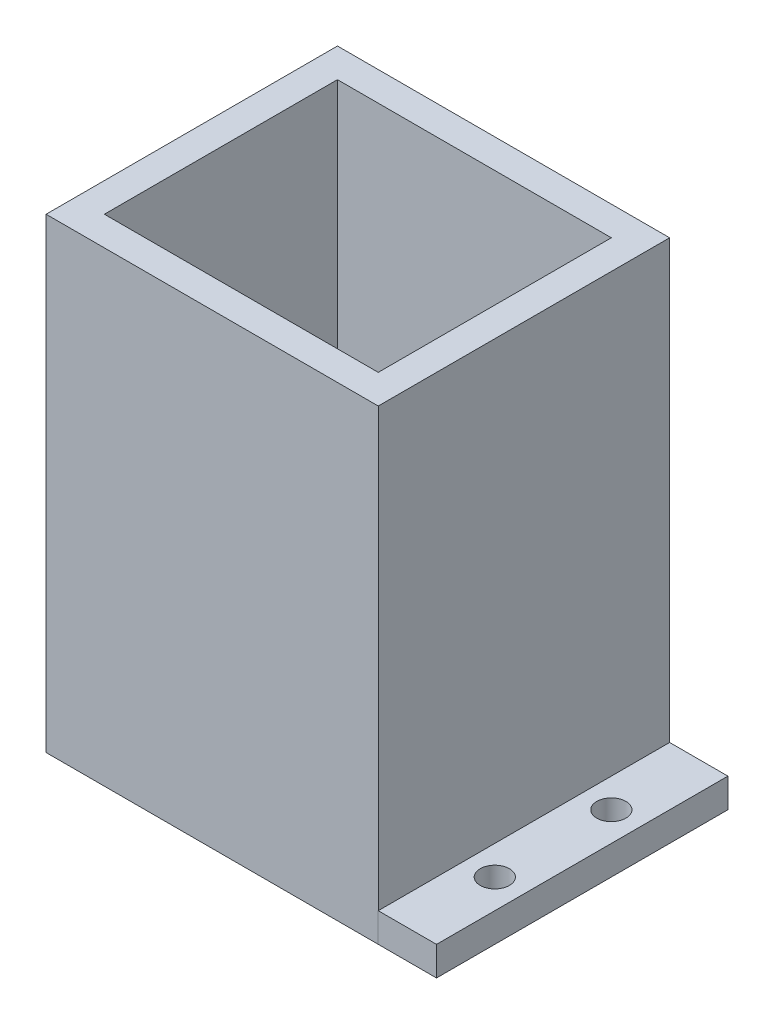
ISO-10303-21;
HEADER;
FILE_DESCRIPTION(('STEP AP214'),'2;1');
FILE_NAME('part.step','',(''),(''),'','','');
FILE_SCHEMA(('AUTOMOTIVE_DESIGN { 1 0 10303 214 1 1 1 1 }'));
ENDSEC;
DATA;
#1=APPLICATION_CONTEXT('core data for automotive mechanical design processes');
#2=APPLICATION_PROTOCOL_DEFINITION('international standard','automotive_design',2000,#1);
#3=PRODUCT_CONTEXT('',#1,'mechanical');
#4=PRODUCT('Part','Part','',(#3));
#5=PRODUCT_RELATED_PRODUCT_CATEGORY('part','',(#4));
#6=PRODUCT_DEFINITION_FORMATION('','',#4);
#7=PRODUCT_DEFINITION_CONTEXT('part definition',#1,'design');
#8=PRODUCT_DEFINITION('design','',#6,#7);
#9=PRODUCT_DEFINITION_SHAPE('','',#8);
#10=(LENGTH_UNIT() NAMED_UNIT(*) SI_UNIT(.MILLI.,.METRE.));
#11=(NAMED_UNIT(*) PLANE_ANGLE_UNIT() SI_UNIT($,.RADIAN.));
#12=(NAMED_UNIT(*) SI_UNIT($,.STERADIAN.) SOLID_ANGLE_UNIT());
#13=UNCERTAINTY_MEASURE_WITH_UNIT(LENGTH_MEASURE(1.E-05),#10,'distance_accuracy_value','');
#14=(GEOMETRIC_REPRESENTATION_CONTEXT(3) GLOBAL_UNCERTAINTY_ASSIGNED_CONTEXT((#13)) GLOBAL_UNIT_ASSIGNED_CONTEXT((#10,
#11,#12)) REPRESENTATION_CONTEXT('',''));
#15=CARTESIAN_POINT('',(0.,0.,0.));
#16=DIRECTION('',(0.,0.,1.));
#17=DIRECTION('',(1.,0.,0.));
#18=AXIS2_PLACEMENT_3D('',#15,#16,#17);
#19=CARTESIAN_POINT('',(53.7182320441989,80.,-2.45303867403315));
#20=DIRECTION('',(-1.,0.,0.));
#21=DIRECTION('',(0.,0.,1.));
#22=AXIS2_PLACEMENT_3D('',#19,#20,#21);
#23=PLANE('',#22);
#24=DIRECTION('',(0.,0.,1.));
#25=VECTOR('',#24,1.);
#26=CARTESIAN_POINT('',(53.7182320441989,5.,-2.45303867403315));
#27=LINE('',#26,#25);
#28=CARTESIAN_POINT('',(53.7182320441989,5.,-2.45303867403315));
#29=VERTEX_POINT('',#28);
#30=CARTESIAN_POINT('',(53.7182320441989,5.,47.5469613259669));
#31=VERTEX_POINT('',#30);
#32=EDGE_CURVE('E56',#29,#31,#27,.T.);
#33=ORIENTED_EDGE('',*,*,#32,.F.);
#34=DIRECTION('',(0.,-1.,0.));
#35=VECTOR('',#34,1.);
#36=CARTESIAN_POINT('',(53.7182320441989,80.,-2.45303867403315));
#37=LINE('',#36,#35);
#38=CARTESIAN_POINT('',(53.7182320441989,80.,-2.45303867403315));
#39=VERTEX_POINT('',#38);
#40=EDGE_CURVE('E206',#39,#29,#37,.T.);
#41=ORIENTED_EDGE('',*,*,#40,.F.);
#42=DIRECTION('',(0.,0.,-1.));
#43=VECTOR('',#42,1.);
#44=CARTESIAN_POINT('',(53.7182320441989,80.,-2.45303867403315));
#45=LINE('',#44,#43);
#46=CARTESIAN_POINT('',(53.7182320441989,80.,47.5469613259669));
#47=VERTEX_POINT('',#46);
#48=EDGE_CURVE('E194',#47,#39,#45,.T.);
#49=ORIENTED_EDGE('',*,*,#48,.F.);
#50=DIRECTION('',(0.,-1.,0.));
#51=VECTOR('',#50,1.);
#52=CARTESIAN_POINT('',(53.7182320441989,80.,47.5469613259669));
#53=LINE('',#52,#51);
#54=EDGE_CURVE('E49',#47,#31,#53,.T.);
#55=ORIENTED_EDGE('',*,*,#54,.T.);
#56=EDGE_LOOP('',(#33,#41,#49,#55));
#57=FACE_BOUND('',#56,.T.);
#58=ADVANCED_FACE('F41',(#57),#23,.F.);
#59=CARTESIAN_POINT('',(-3.28176795580111,80.,-2.45303867403315));
#60=DIRECTION('',(1.,0.,0.));
#61=DIRECTION('',(0.,0.,-1.));
#62=AXIS2_PLACEMENT_3D('',#59,#60,#61);
#63=PLANE('',#62);
#64=DIRECTION('',(0.,0.,1.));
#65=VECTOR('',#64,1.);
#66=CARTESIAN_POINT('',(-3.28176795580111,0.,-2.45303867403315));
#67=LINE('',#66,#65);
#68=CARTESIAN_POINT('',(-3.28176795580111,0.,-2.45303867403315));
#69=VERTEX_POINT('',#68);
#70=CARTESIAN_POINT('',(-3.2817679558011,0.,47.5469613259669));
#71=VERTEX_POINT('',#70);
#72=EDGE_CURVE('E182',#69,#71,#67,.T.);
#73=ORIENTED_EDGE('',*,*,#72,.T.);
#74=DIRECTION('',(0.,-1.,0.));
#75=VECTOR('',#74,1.);
#76=CARTESIAN_POINT('',(-3.2817679558011,80.,47.5469613259669));
#77=LINE('',#76,#75);
#78=CARTESIAN_POINT('',(-3.2817679558011,80.,47.5469613259669));
#79=VERTEX_POINT('',#78);
#80=EDGE_CURVE('E11',#79,#71,#77,.T.);
#81=ORIENTED_EDGE('',*,*,#80,.F.);
#82=DIRECTION('',(0.,0.,1.));
#83=VECTOR('',#82,1.);
#84=CARTESIAN_POINT('',(-3.28176795580111,80.,-2.45303867403315));
#85=LINE('',#84,#83);
#86=CARTESIAN_POINT('',(-3.28176795580111,80.,-2.45303867403315));
#87=VERTEX_POINT('',#86);
#88=EDGE_CURVE('E188',#87,#79,#85,.T.);
#89=ORIENTED_EDGE('',*,*,#88,.F.);
#90=DIRECTION('',(0.,-1.,0.));
#91=VECTOR('',#90,1.);
#92=CARTESIAN_POINT('',(-3.28176795580111,80.,-2.45303867403315));
#93=LINE('',#92,#91);
#94=EDGE_CURVE('E198',#87,#69,#93,.T.);
#95=ORIENTED_EDGE('',*,*,#94,.T.);
#96=EDGE_LOOP('',(#73,#81,#89,#95));
#97=FACE_BOUND('',#96,.T.);
#98=ADVANCED_FACE('F43',(#97),#63,.F.);
#99=CARTESIAN_POINT('',(-3.2817679558011,80.,47.5469613259669));
#100=DIRECTION('',(0.,0.,-1.));
#101=DIRECTION('',(-1.,0.,0.));
#102=AXIS2_PLACEMENT_3D('',#99,#100,#101);
#103=PLANE('',#102);
#104=DIRECTION('',(1.,0.,0.));
#105=VECTOR('',#104,1.);
#106=CARTESIAN_POINT('',(-3.2817679558011,0.,47.5469613259669));
#107=LINE('',#106,#105);
#108=CARTESIAN_POINT('',(53.7182320441989,0.,47.5469613259669));
#109=VERTEX_POINT('',#108);
#110=EDGE_CURVE('E201',#71,#109,#107,.T.);
#111=ORIENTED_EDGE('',*,*,#110,.T.);
#112=EDGE_CURVE('E207',#31,#109,#53,.T.);
#113=ORIENTED_EDGE('',*,*,#112,.F.);
#114=ORIENTED_EDGE('',*,*,#54,.F.);
#115=DIRECTION('',(1.,0.,0.));
#116=VECTOR('',#115,1.);
#117=CARTESIAN_POINT('',(-3.2817679558011,80.,47.5469613259669));
#118=LINE('',#117,#116);
#119=EDGE_CURVE('E191',#79,#47,#118,.T.);
#120=ORIENTED_EDGE('',*,*,#119,.F.);
#121=ORIENTED_EDGE('',*,*,#80,.T.);
#122=EDGE_LOOP('',(#111,#113,#114,#120,#121));
#123=FACE_BOUND('',#122,.T.);
#124=ADVANCED_FACE('F264',(#123),#103,.F.);
#125=CARTESIAN_POINT('',(-3.28176795580111,80.,-2.45303867403315));
#126=DIRECTION('',(0.,0.,1.));
#127=DIRECTION('',(1.,0.,0.));
#128=AXIS2_PLACEMENT_3D('',#125,#126,#127);
#129=PLANE('',#128);
#130=DIRECTION('',(-1.,0.,0.));
#131=VECTOR('',#130,1.);
#132=CARTESIAN_POINT('',(-3.28176795580111,0.,-2.45303867403315));
#133=LINE('',#132,#131);
#134=CARTESIAN_POINT('',(63.7182320441989,0.,-2.45303867403315));
#135=VERTEX_POINT('',#134);
#136=EDGE_CURVE('E192',#135,#69,#133,.T.);
#137=ORIENTED_EDGE('',*,*,#136,.T.);
#138=ORIENTED_EDGE('',*,*,#94,.F.);
#139=DIRECTION('',(-1.,0.,0.));
#140=VECTOR('',#139,1.);
#141=CARTESIAN_POINT('',(-3.28176795580111,80.,-2.45303867403315));
#142=LINE('',#141,#140);
#143=EDGE_CURVE('E196',#39,#87,#142,.T.);
#144=ORIENTED_EDGE('',*,*,#143,.F.);
#145=ORIENTED_EDGE('',*,*,#40,.T.);
#146=DIRECTION('',(-1.,0.,0.));
#147=VECTOR('',#146,1.);
#148=CARTESIAN_POINT('',(53.7182320441989,5.,-2.45303867403315));
#149=LINE('',#148,#147);
#150=CARTESIAN_POINT('',(63.7182320441989,5.,-2.45303867403315));
#151=VERTEX_POINT('',#150);
#152=EDGE_CURVE('E225',#151,#29,#149,.T.);
#153=ORIENTED_EDGE('',*,*,#152,.F.);
#154=DIRECTION('',(0.,-1.,0.));
#155=VECTOR('',#154,1.);
#156=CARTESIAN_POINT('',(63.7182320441989,5.,-2.45303867403315));
#157=LINE('',#156,#155);
#158=EDGE_CURVE('E155',#151,#135,#157,.T.);
#159=ORIENTED_EDGE('',*,*,#158,.T.);
#160=EDGE_LOOP('',(#137,#138,#144,#145,#153,#159));
#161=FACE_BOUND('',#160,.T.);
#162=ADVANCED_FACE('F267',(#161),#129,.F.);
#163=CARTESIAN_POINT('',(0.,80.,0.));
#164=DIRECTION('',(0.,1.,0.));
#165=DIRECTION('',(0.,0.,1.));
#166=AXIS2_PLACEMENT_3D('',#163,#164,#165);
#167=PLANE('',#166);
#168=DIRECTION('',(0.,0.,1.));
#169=VECTOR('',#168,1.);
#170=CARTESIAN_POINT('',(1.71823204419891,80.,2.54696132596685));
#171=LINE('',#170,#169);
#172=CARTESIAN_POINT('',(1.71823204419891,80.,2.54696132596685));
#173=VERTEX_POINT('',#172);
#174=CARTESIAN_POINT('',(1.71823204419891,80.,42.5469613259669));
#175=VERTEX_POINT('',#174);
#176=EDGE_CURVE('E64',#173,#175,#171,.T.);
#177=ORIENTED_EDGE('',*,*,#176,.F.);
#178=DIRECTION('',(-1.,0.,0.));
#179=VECTOR('',#178,1.);
#180=CARTESIAN_POINT('',(1.71823204419891,80.,2.54696132596685));
#181=LINE('',#180,#179);
#182=CARTESIAN_POINT('',(48.7182320441989,80.,2.54696132596685));
#183=VERTEX_POINT('',#182);
#184=EDGE_CURVE('E163',#183,#173,#181,.T.);
#185=ORIENTED_EDGE('',*,*,#184,.F.);
#186=DIRECTION('',(0.,0.,-1.));
#187=VECTOR('',#186,1.);
#188=CARTESIAN_POINT('',(48.7182320441989,80.,2.54696132596685));
#189=LINE('',#188,#187);
#190=CARTESIAN_POINT('',(48.7182320441989,80.,42.5469613259669));
#191=VERTEX_POINT('',#190);
#192=EDGE_CURVE('E175',#191,#183,#189,.T.);
#193=ORIENTED_EDGE('',*,*,#192,.F.);
#194=DIRECTION('',(1.,0.,0.));
#195=VECTOR('',#194,1.);
#196=CARTESIAN_POINT('',(1.71823204419891,80.,42.5469613259669));
#197=LINE('',#196,#195);
#198=EDGE_CURVE('E153',#175,#191,#197,.T.);
#199=ORIENTED_EDGE('',*,*,#198,.F.);
#200=EDGE_LOOP('',(#177,#185,#193,#199));
#201=FACE_BOUND('',#200,.T.);
#202=ORIENTED_EDGE('',*,*,#88,.T.);
#203=ORIENTED_EDGE('',*,*,#119,.T.);
#204=ORIENTED_EDGE('',*,*,#48,.T.);
#205=ORIENTED_EDGE('',*,*,#143,.T.);
#206=EDGE_LOOP('',(#202,#203,#204,#205));
#207=FACE_BOUND('',#206,.T.);
#208=ADVANCED_FACE('F273',(#201,#207),#167,.T.);
#209=CARTESIAN_POINT('',(0.,0.,0.));
#210=DIRECTION('',(0.,1.,0.));
#211=DIRECTION('',(0.,0.,1.));
#212=AXIS2_PLACEMENT_3D('',#209,#210,#211);
#213=PLANE('',#212);
#214=ORIENTED_EDGE('',*,*,#72,.F.);
#215=ORIENTED_EDGE('',*,*,#136,.F.);
#216=DIRECTION('',(0.,0.,-1.));
#217=VECTOR('',#216,1.);
#218=CARTESIAN_POINT('',(63.7182320441989,0.,-2.45303867403315));
#219=LINE('',#218,#217);
#220=CARTESIAN_POINT('',(63.7182320441989,0.,47.5510673048378));
#221=VERTEX_POINT('',#220);
#222=EDGE_CURVE('E137',#221,#135,#219,.T.);
#223=ORIENTED_EDGE('',*,*,#222,.F.);
#224=DIRECTION('',(1.,0.,0.));
#225=VECTOR('',#224,1.);
#226=CARTESIAN_POINT('',(53.7182320441989,0.,47.5510673048378));
#227=LINE('',#226,#225);
#228=CARTESIAN_POINT('',(53.7182320441989,0.,47.5510673048378));
#229=VERTEX_POINT('',#228);
#230=EDGE_CURVE('E217',#229,#221,#227,.T.);
#231=ORIENTED_EDGE('',*,*,#230,.F.);
#232=DIRECTION('',(0.,0.,1.));
#233=VECTOR('',#232,1.);
#234=CARTESIAN_POINT('',(53.7182320441989,0.,-2.45303867403315));
#235=LINE('',#234,#233);
#236=EDGE_CURVE('E150',#109,#229,#235,.T.);
#237=ORIENTED_EDGE('',*,*,#236,.F.);
#238=ORIENTED_EDGE('',*,*,#110,.F.);
#239=EDGE_LOOP('',(#214,#215,#223,#231,#237,#238));
#240=FACE_BOUND('',#239,.T.);
#241=CARTESIAN_POINT('',(58.7182320441989,0.,12.5510673048378));
#242=DIRECTION('',(0.,1.,0.));
#243=DIRECTION('',(0.,0.,1.));
#244=AXIS2_PLACEMENT_3D('',#241,#242,#243);
#245=CIRCLE('',#244,2.5);
#246=CARTESIAN_POINT('',(58.7182320441989,0.,15.0510673048378));
#247=VERTEX_POINT('',#246);
#248=EDGE_CURVE('E222',#247,#247,#245,.T.);
#249=ORIENTED_EDGE('',*,*,#248,.T.);
#250=EDGE_LOOP('',(#249));
#251=FACE_BOUND('',#250,.T.);
#252=CARTESIAN_POINT('',(58.7182320441989,0.,32.5510673048378));
#253=DIRECTION('',(0.,1.,0.));
#254=DIRECTION('',(0.,0.,1.));
#255=AXIS2_PLACEMENT_3D('',#252,#253,#254);
#256=CIRCLE('',#255,2.5);
#257=CARTESIAN_POINT('',(58.7182320441989,0.,35.0510673048378));
#258=VERTEX_POINT('',#257);
#259=EDGE_CURVE('E237',#258,#258,#256,.T.);
#260=ORIENTED_EDGE('',*,*,#259,.T.);
#261=EDGE_LOOP('',(#260));
#262=FACE_BOUND('',#261,.T.);
#263=ADVANCED_FACE('F214',(#240,#251,#262),#213,.F.);
#264=CARTESIAN_POINT('',(1.71823204419891,5.,2.54696132596685));
#265=DIRECTION('',(-1.,0.,0.));
#266=DIRECTION('',(0.,0.,1.));
#267=AXIS2_PLACEMENT_3D('',#264,#265,#266);
#268=PLANE('',#267);
#269=ORIENTED_EDGE('',*,*,#176,.T.);
#270=DIRECTION('',(0.,1.,0.));
#271=VECTOR('',#270,1.);
#272=CARTESIAN_POINT('',(1.71823204419891,5.,42.5469613259669));
#273=LINE('',#272,#271);
#274=CARTESIAN_POINT('',(1.71823204419891,5.,42.5469613259669));
#275=VERTEX_POINT('',#274);
#276=EDGE_CURVE('E171',#275,#175,#273,.T.);
#277=ORIENTED_EDGE('',*,*,#276,.F.);
#278=DIRECTION('',(0.,0.,1.));
#279=VECTOR('',#278,1.);
#280=CARTESIAN_POINT('',(1.71823204419891,5.,2.54696132596685));
#281=LINE('',#280,#279);
#282=CARTESIAN_POINT('',(1.71823204419891,5.,2.54696132596685));
#283=VERTEX_POINT('',#282);
#284=EDGE_CURVE('E159',#283,#275,#281,.T.);
#285=ORIENTED_EDGE('',*,*,#284,.F.);
#286=DIRECTION('',(0.,1.,0.));
#287=VECTOR('',#286,1.);
#288=CARTESIAN_POINT('',(1.71823204419891,5.,2.54696132596685));
#289=LINE('',#288,#287);
#290=EDGE_CURVE('E180',#283,#173,#289,.T.);
#291=ORIENTED_EDGE('',*,*,#290,.T.);
#292=EDGE_LOOP('',(#269,#277,#285,#291));
#293=FACE_BOUND('',#292,.T.);
#294=ADVANCED_FACE('F286',(#293),#268,.F.);
#295=CARTESIAN_POINT('',(1.71823204419891,5.,2.54696132596685));
#296=DIRECTION('',(0.,0.,-1.));
#297=DIRECTION('',(-1.,0.,0.));
#298=AXIS2_PLACEMENT_3D('',#295,#296,#297);
#299=PLANE('',#298);
#300=ORIENTED_EDGE('',*,*,#184,.T.);
#301=ORIENTED_EDGE('',*,*,#290,.F.);
#302=DIRECTION('',(-1.,0.,0.));
#303=VECTOR('',#302,1.);
#304=CARTESIAN_POINT('',(1.71823204419891,5.,2.54696132596685));
#305=LINE('',#304,#303);
#306=CARTESIAN_POINT('',(48.7182320441989,5.,2.54696132596685));
#307=VERTEX_POINT('',#306);
#308=EDGE_CURVE('E169',#307,#283,#305,.T.);
#309=ORIENTED_EDGE('',*,*,#308,.F.);
#310=DIRECTION('',(0.,1.,0.));
#311=VECTOR('',#310,1.);
#312=CARTESIAN_POINT('',(48.7182320441989,5.,2.54696132596685));
#313=LINE('',#312,#311);
#314=EDGE_CURVE('E183',#307,#183,#313,.T.);
#315=ORIENTED_EDGE('',*,*,#314,.T.);
#316=EDGE_LOOP('',(#300,#301,#309,#315));
#317=FACE_BOUND('',#316,.T.);
#318=ADVANCED_FACE('F290',(#317),#299,.F.);
#319=CARTESIAN_POINT('',(48.7182320441989,5.,2.54696132596685));
#320=DIRECTION('',(1.,0.,0.));
#321=DIRECTION('',(0.,0.,-1.));
#322=AXIS2_PLACEMENT_3D('',#319,#320,#321);
#323=PLANE('',#322);
#324=ORIENTED_EDGE('',*,*,#192,.T.);
#325=ORIENTED_EDGE('',*,*,#314,.F.);
#326=DIRECTION('',(0.,0.,-1.));
#327=VECTOR('',#326,1.);
#328=CARTESIAN_POINT('',(48.7182320441989,5.,2.54696132596685));
#329=LINE('',#328,#327);
#330=CARTESIAN_POINT('',(48.7182320441989,5.,42.5469613259669));
#331=VERTEX_POINT('',#330);
#332=EDGE_CURVE('E166',#331,#307,#329,.T.);
#333=ORIENTED_EDGE('',*,*,#332,.F.);
#334=DIRECTION('',(0.,1.,0.));
#335=VECTOR('',#334,1.);
#336=CARTESIAN_POINT('',(48.7182320441989,5.,42.5469613259669));
#337=LINE('',#336,#335);
#338=EDGE_CURVE('E185',#331,#191,#337,.T.);
#339=ORIENTED_EDGE('',*,*,#338,.T.);
#340=EDGE_LOOP('',(#324,#325,#333,#339));
#341=FACE_BOUND('',#340,.T.);
#342=ADVANCED_FACE('F294',(#341),#323,.F.);
#343=CARTESIAN_POINT('',(1.71823204419891,5.,42.5469613259669));
#344=DIRECTION('',(0.,0.,1.));
#345=DIRECTION('',(1.,0.,0.));
#346=AXIS2_PLACEMENT_3D('',#343,#344,#345);
#347=PLANE('',#346);
#348=ORIENTED_EDGE('',*,*,#198,.T.);
#349=ORIENTED_EDGE('',*,*,#338,.F.);
#350=DIRECTION('',(1.,0.,0.));
#351=VECTOR('',#350,1.);
#352=CARTESIAN_POINT('',(1.71823204419891,5.,42.5469613259669));
#353=LINE('',#352,#351);
#354=EDGE_CURVE('E162',#275,#331,#353,.T.);
#355=ORIENTED_EDGE('',*,*,#354,.F.);
#356=ORIENTED_EDGE('',*,*,#276,.T.);
#357=EDGE_LOOP('',(#348,#349,#355,#356));
#358=FACE_BOUND('',#357,.T.);
#359=ADVANCED_FACE('F291',(#358),#347,.F.);
#360=CARTESIAN_POINT('',(0.,5.,0.));
#361=DIRECTION('',(0.,1.,0.));
#362=DIRECTION('',(0.,0.,1.));
#363=AXIS2_PLACEMENT_3D('',#360,#361,#362);
#364=PLANE('',#363);
#365=ORIENTED_EDGE('',*,*,#284,.T.);
#366=ORIENTED_EDGE('',*,*,#354,.T.);
#367=ORIENTED_EDGE('',*,*,#332,.T.);
#368=ORIENTED_EDGE('',*,*,#308,.T.);
#369=EDGE_LOOP('',(#365,#366,#367,#368));
#370=FACE_BOUND('',#369,.T.);
#371=ADVANCED_FACE('F254',(#370),#364,.T.);
#372=CARTESIAN_POINT('',(53.7182320441989,5.,-2.45303867403315));
#373=DIRECTION('',(1.,0.,0.));
#374=DIRECTION('',(0.,0.,-1.));
#375=AXIS2_PLACEMENT_3D('',#372,#373,#374);
#376=PLANE('',#375);
#377=CARTESIAN_POINT('',(53.7182320441989,5.,47.5510673048378));
#378=VERTEX_POINT('',#377);
#379=EDGE_CURVE('E127',#31,#378,#27,.T.);
#380=ORIENTED_EDGE('',*,*,#379,.F.);
#381=ORIENTED_EDGE('',*,*,#112,.T.);
#382=ORIENTED_EDGE('',*,*,#236,.T.);
#383=DIRECTION('',(0.,-1.,0.));
#384=VECTOR('',#383,1.);
#385=CARTESIAN_POINT('',(53.7182320441989,5.,47.5510673048378));
#386=LINE('',#385,#384);
#387=EDGE_CURVE('E142',#378,#229,#386,.T.);
#388=ORIENTED_EDGE('',*,*,#387,.F.);
#389=EDGE_LOOP('',(#380,#381,#382,#388));
#390=FACE_BOUND('',#389,.T.);
#391=ADVANCED_FACE('F148',(#390),#376,.F.);
#392=CARTESIAN_POINT('',(0.,5.,0.));
#393=DIRECTION('',(0.,1.,0.));
#394=DIRECTION('',(0.,0.,1.));
#395=AXIS2_PLACEMENT_3D('',#392,#393,#394);
#396=PLANE('',#395);
#397=CARTESIAN_POINT('',(58.7182320441989,5.,12.5510673048378));
#398=DIRECTION('',(0.,1.,0.));
#399=DIRECTION('',(0.,0.,1.));
#400=AXIS2_PLACEMENT_3D('',#397,#398,#399);
#401=CIRCLE('',#400,2.5);
#402=CARTESIAN_POINT('',(58.7182320441989,5.,15.0510673048378));
#403=VERTEX_POINT('',#402);
#404=EDGE_CURVE('E218',#403,#403,#401,.T.);
#405=ORIENTED_EDGE('',*,*,#404,.F.);
#406=EDGE_LOOP('',(#405));
#407=FACE_BOUND('',#406,.T.);
#408=ORIENTED_EDGE('',*,*,#32,.T.);
#409=ORIENTED_EDGE('',*,*,#379,.T.);
#410=DIRECTION('',(1.,0.,0.));
#411=VECTOR('',#410,1.);
#412=CARTESIAN_POINT('',(53.7182320441989,5.,47.5510673048378));
#413=LINE('',#412,#411);
#414=CARTESIAN_POINT('',(63.7182320441989,5.,47.5510673048378));
#415=VERTEX_POINT('',#414);
#416=EDGE_CURVE('E131',#378,#415,#413,.T.);
#417=ORIENTED_EDGE('',*,*,#416,.T.);
#418=DIRECTION('',(0.,0.,-1.));
#419=VECTOR('',#418,1.);
#420=CARTESIAN_POINT('',(63.7182320441989,5.,-2.45303867403315));
#421=LINE('',#420,#419);
#422=EDGE_CURVE('E146',#415,#151,#421,.T.);
#423=ORIENTED_EDGE('',*,*,#422,.T.);
#424=ORIENTED_EDGE('',*,*,#152,.T.);
#425=EDGE_LOOP('',(#408,#409,#417,#423,#424));
#426=FACE_BOUND('',#425,.T.);
#427=CARTESIAN_POINT('',(58.7182320441989,5.,32.5510673048378));
#428=DIRECTION('',(0.,1.,0.));
#429=DIRECTION('',(0.,0.,1.));
#430=AXIS2_PLACEMENT_3D('',#427,#428,#429);
#431=CIRCLE('',#430,2.5);
#432=CARTESIAN_POINT('',(58.7182320441989,5.,35.0510673048378));
#433=VERTEX_POINT('',#432);
#434=EDGE_CURVE('E235',#433,#433,#431,.T.);
#435=ORIENTED_EDGE('',*,*,#434,.F.);
#436=EDGE_LOOP('',(#435));
#437=FACE_BOUND('',#436,.T.);
#438=ADVANCED_FACE('F129',(#407,#426,#437),#396,.T.);
#439=CARTESIAN_POINT('',(53.7182320441989,5.,47.5510673048378));
#440=DIRECTION('',(0.,0.,-1.));
#441=DIRECTION('',(-1.,0.,0.));
#442=AXIS2_PLACEMENT_3D('',#439,#440,#441);
#443=PLANE('',#442);
#444=ORIENTED_EDGE('',*,*,#230,.T.);
#445=DIRECTION('',(0.,-1.,0.));
#446=VECTOR('',#445,1.);
#447=CARTESIAN_POINT('',(63.7182320441989,5.,47.5510673048378));
#448=LINE('',#447,#446);
#449=EDGE_CURVE('E144',#415,#221,#448,.T.);
#450=ORIENTED_EDGE('',*,*,#449,.F.);
#451=ORIENTED_EDGE('',*,*,#416,.F.);
#452=ORIENTED_EDGE('',*,*,#387,.T.);
#453=EDGE_LOOP('',(#444,#450,#451,#452));
#454=FACE_BOUND('',#453,.T.);
#455=ADVANCED_FACE('F141',(#454),#443,.F.);
#456=CARTESIAN_POINT('',(63.7182320441989,5.,-2.45303867403315));
#457=DIRECTION('',(-1.,0.,0.));
#458=DIRECTION('',(0.,0.,1.));
#459=AXIS2_PLACEMENT_3D('',#456,#457,#458);
#460=PLANE('',#459);
#461=ORIENTED_EDGE('',*,*,#222,.T.);
#462=ORIENTED_EDGE('',*,*,#158,.F.);
#463=ORIENTED_EDGE('',*,*,#422,.F.);
#464=ORIENTED_EDGE('',*,*,#449,.T.);
#465=EDGE_LOOP('',(#461,#462,#463,#464));
#466=FACE_BOUND('',#465,.T.);
#467=ADVANCED_FACE('F252',(#466),#460,.F.);
#468=CARTESIAN_POINT('',(58.7182320441989,5.,12.5510673048378));
#469=DIRECTION('',(0.,-1.,0.));
#470=DIRECTION('',(0.,0.,-1.));
#471=AXIS2_PLACEMENT_3D('',#468,#469,#470);
#472=CYLINDRICAL_SURFACE('',#471,2.5);
#473=ORIENTED_EDGE('',*,*,#404,.T.);
#474=EDGE_LOOP('',(#473));
#475=FACE_BOUND('',#474,.T.);
#476=ORIENTED_EDGE('',*,*,#248,.F.);
#477=EDGE_LOOP('',(#476));
#478=FACE_BOUND('',#477,.T.);
#479=ADVANCED_FACE('F305',(#475,#478),#472,.F.);
#480=CARTESIAN_POINT('',(58.7182320441989,5.,32.5510673048378));
#481=DIRECTION('',(0.,-1.,0.));
#482=DIRECTION('',(0.,0.,-1.));
#483=AXIS2_PLACEMENT_3D('',#480,#481,#482);
#484=CYLINDRICAL_SURFACE('',#483,2.5);
#485=ORIENTED_EDGE('',*,*,#434,.T.);
#486=EDGE_LOOP('',(#485));
#487=FACE_BOUND('',#486,.T.);
#488=ORIENTED_EDGE('',*,*,#259,.F.);
#489=EDGE_LOOP('',(#488));
#490=FACE_BOUND('',#489,.T.);
#491=ADVANCED_FACE('F243',(#487,#490),#484,.F.);
#492=CLOSED_SHELL('',(#58,#98,#124,#162,#208,#263,#294,#318,#342,#359,#371,#391,#438,#455,#467,
#479,#491));
#493=MANIFOLD_SOLID_BREP('B2',#492);
#494=ADVANCED_BREP_SHAPE_REPRESENTATION('',(#18,#493),#14);
#495=SHAPE_DEFINITION_REPRESENTATION(#9,#494);
ENDSEC;
END-ISO-10303-21;
